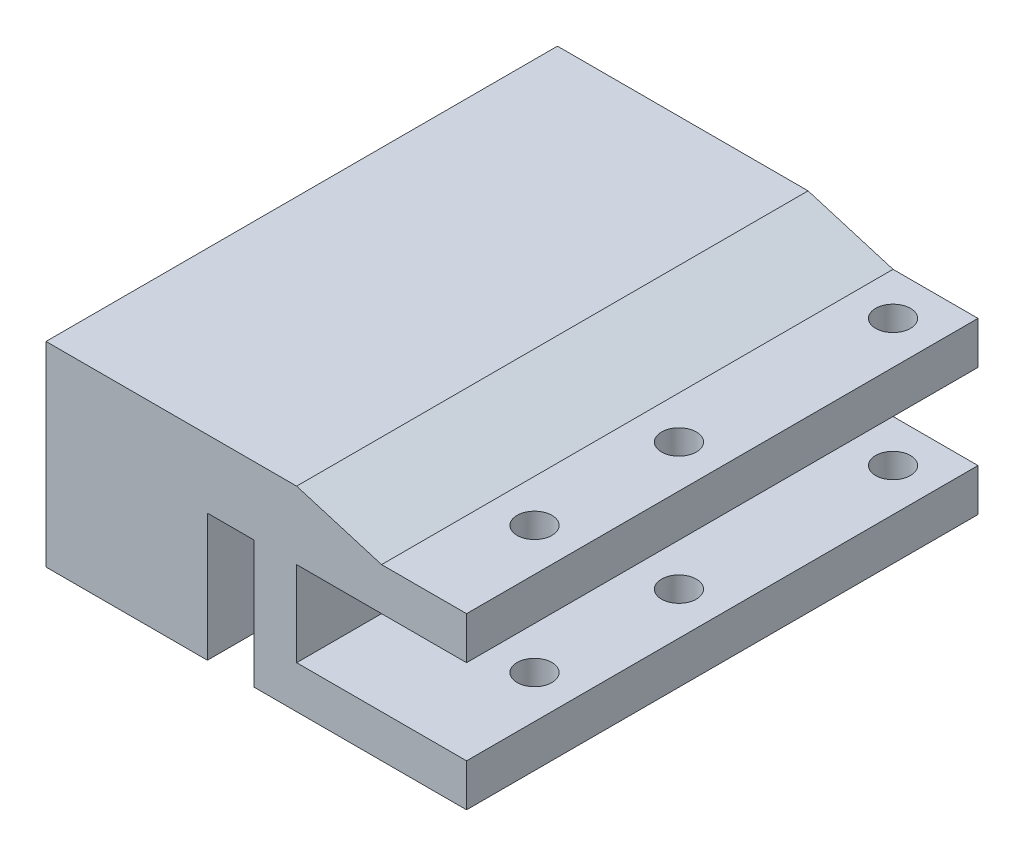
ISO-10303-21;
HEADER;
FILE_DESCRIPTION(('STEP AP214'),'2;1');
FILE_NAME('part.step','',(''),(''),'','','');
FILE_SCHEMA(('AUTOMOTIVE_DESIGN { 1 0 10303 214 1 1 1 1 }'));
ENDSEC;
DATA;
#1=APPLICATION_CONTEXT('core data for automotive mechanical design processes');
#2=APPLICATION_PROTOCOL_DEFINITION('international standard','automotive_design',2000,#1);
#3=PRODUCT_CONTEXT('',#1,'mechanical');
#4=PRODUCT('Part','Part','',(#3));
#5=PRODUCT_RELATED_PRODUCT_CATEGORY('part','',(#4));
#6=PRODUCT_DEFINITION_FORMATION('','',#4);
#7=PRODUCT_DEFINITION_CONTEXT('part definition',#1,'design');
#8=PRODUCT_DEFINITION('design','',#6,#7);
#9=PRODUCT_DEFINITION_SHAPE('','',#8);
#10=(LENGTH_UNIT() NAMED_UNIT(*) SI_UNIT(.MILLI.,.METRE.));
#11=(NAMED_UNIT(*) PLANE_ANGLE_UNIT() SI_UNIT($,.RADIAN.));
#12=(NAMED_UNIT(*) SI_UNIT($,.STERADIAN.) SOLID_ANGLE_UNIT());
#13=UNCERTAINTY_MEASURE_WITH_UNIT(LENGTH_MEASURE(1.E-05),#10,'distance_accuracy_value','');
#14=(GEOMETRIC_REPRESENTATION_CONTEXT(3) GLOBAL_UNCERTAINTY_ASSIGNED_CONTEXT((#13)) GLOBAL_UNIT_ASSIGNED_CONTEXT((#10,
#11,#12)) REPRESENTATION_CONTEXT('',''));
#15=CARTESIAN_POINT('',(0.,0.,0.));
#16=DIRECTION('',(0.,0.,1.));
#17=DIRECTION('',(1.,0.,0.));
#18=AXIS2_PLACEMENT_3D('',#15,#16,#17);
#19=CARTESIAN_POINT('',(0.,0.,10.));
#20=DIRECTION('',(0.,1.,0.));
#21=DIRECTION('',(0.,0.,1.));
#22=AXIS2_PLACEMENT_3D('',#19,#20,#21);
#23=PLANE('',#22);
#24=DIRECTION('',(1.,0.,0.));
#25=VECTOR('',#24,1.);
#26=CARTESIAN_POINT('',(0.,0.,0.));
#27=LINE('',#26,#25);
#28=CARTESIAN_POINT('',(0.,0.,0.));
#29=VERTEX_POINT('',#28);
#30=CARTESIAN_POINT('',(19.,0.,0.));
#31=VERTEX_POINT('',#30);
#32=EDGE_CURVE('E196',#29,#31,#27,.T.);
#33=ORIENTED_EDGE('',*,*,#32,.T.);
#34=DIRECTION('',(0.,0.,1.));
#35=VECTOR('',#34,1.);
#36=CARTESIAN_POINT('',(19.,0.,-10.));
#37=LINE('',#36,#35);
#38=CARTESIAN_POINT('',(19.,0.,10.));
#39=VERTEX_POINT('',#38);
#40=EDGE_CURVE('E179',#31,#39,#37,.T.);
#41=ORIENTED_EDGE('',*,*,#40,.T.);
#42=DIRECTION('',(1.,0.,0.));
#43=VECTOR('',#42,1.);
#44=CARTESIAN_POINT('',(0.,0.,10.));
#45=LINE('',#44,#43);
#46=CARTESIAN_POINT('',(0.,0.,10.));
#47=VERTEX_POINT('',#46);
#48=EDGE_CURVE('E194',#47,#39,#45,.T.);
#49=ORIENTED_EDGE('',*,*,#48,.F.);
#50=DIRECTION('',(0.,0.,-1.));
#51=VECTOR('',#50,1.);
#52=CARTESIAN_POINT('',(0.,0.,10.));
#53=LINE('',#52,#51);
#54=EDGE_CURVE('E227',#47,#29,#53,.T.);
#55=ORIENTED_EDGE('',*,*,#54,.T.);
#56=EDGE_LOOP('',(#33,#41,#49,#55));
#57=FACE_BOUND('',#56,.T.);
#58=ADVANCED_FACE('F38',(#57),#23,.F.);
#59=CARTESIAN_POINT('',(0.,0.,0.));
#60=DIRECTION('',(0.,0.,1.));
#61=DIRECTION('',(1.,0.,0.));
#62=AXIS2_PLACEMENT_3D('',#59,#60,#61);
#63=PLANE('',#62);
#64=DIRECTION('',(-1.,0.,0.));
#65=VECTOR('',#64,1.);
#66=CARTESIAN_POINT('',(0.,15.,0.));
#67=LINE('',#66,#65);
#68=CARTESIAN_POINT('',(24.5,15.,0.));
#69=VERTEX_POINT('',#68);
#70=CARTESIAN_POINT('',(19.,15.,0.));
#71=VERTEX_POINT('',#70);
#72=EDGE_CURVE('E289',#69,#71,#67,.T.);
#73=ORIENTED_EDGE('',*,*,#72,.T.);
#74=DIRECTION('',(0.,-1.,0.));
#75=VECTOR('',#74,1.);
#76=CARTESIAN_POINT('',(19.,0.,0.));
#77=LINE('',#76,#75);
#78=EDGE_CURVE('E292',#71,#31,#77,.T.);
#79=ORIENTED_EDGE('',*,*,#78,.T.);
#80=ORIENTED_EDGE('',*,*,#32,.F.);
#81=DIRECTION('',(0.,-1.,0.));
#82=VECTOR('',#81,1.);
#83=CARTESIAN_POINT('',(0.,0.,0.));
#84=LINE('',#83,#82);
#85=CARTESIAN_POINT('',(0.,20.,0.));
#86=VERTEX_POINT('',#85);
#87=EDGE_CURVE('E208',#86,#29,#84,.T.);
#88=ORIENTED_EDGE('',*,*,#87,.F.);
#89=DIRECTION('',(-1.,0.,0.));
#90=VECTOR('',#89,1.);
#91=CARTESIAN_POINT('',(0.,20.,0.));
#92=LINE('',#91,#90);
#93=CARTESIAN_POINT('',(29.5,20.,0.));
#94=VERTEX_POINT('',#93);
#95=EDGE_CURVE('E63',#94,#86,#92,.T.);
#96=ORIENTED_EDGE('',*,*,#95,.F.);
#97=DIRECTION('',(0.,1.,0.));
#98=VECTOR('',#97,1.);
#99=CARTESIAN_POINT('',(29.5,20.,0.));
#100=LINE('',#99,#98);
#101=CARTESIAN_POINT('',(29.5,15.,0.));
#102=VERTEX_POINT('',#101);
#103=EDGE_CURVE('E357',#102,#94,#100,.T.);
#104=ORIENTED_EDGE('',*,*,#103,.F.);
#105=DIRECTION('',(0.,1.,0.));
#106=VECTOR('',#105,1.);
#107=CARTESIAN_POINT('',(29.5,15.,0.));
#108=LINE('',#107,#106);
#109=CARTESIAN_POINT('',(29.5,5.,0.));
#110=VERTEX_POINT('',#109);
#111=EDGE_CURVE('E229',#110,#102,#108,.T.);
#112=ORIENTED_EDGE('',*,*,#111,.F.);
#113=DIRECTION('',(0.,1.,0.));
#114=VECTOR('',#113,1.);
#115=CARTESIAN_POINT('',(29.5,5.,0.));
#116=LINE('',#115,#114);
#117=CARTESIAN_POINT('',(29.5,0.,0.));
#118=VERTEX_POINT('',#117);
#119=EDGE_CURVE('E354',#118,#110,#116,.T.);
#120=ORIENTED_EDGE('',*,*,#119,.F.);
#121=CARTESIAN_POINT('',(24.5,0.,0.));
#122=VERTEX_POINT('',#121);
#123=EDGE_CURVE('E230',#122,#118,#27,.T.);
#124=ORIENTED_EDGE('',*,*,#123,.F.);
#125=DIRECTION('',(0.,1.,0.));
#126=VECTOR('',#125,1.);
#127=CARTESIAN_POINT('',(24.5,0.,0.));
#128=LINE('',#127,#126);
#129=EDGE_CURVE('E283',#122,#69,#128,.T.);
#130=ORIENTED_EDGE('',*,*,#129,.T.);
#131=EDGE_LOOP('',(#73,#79,#80,#88,#96,#104,#112,#120,#124,#130));
#132=FACE_BOUND('',#131,.T.);
#133=ADVANCED_FACE('F378',(#132),#63,.F.);
#134=CARTESIAN_POINT('',(44.5,0.,-3.));
#135=DIRECTION('',(0.,-1.,0.));
#136=DIRECTION('',(0.,0.,-1.));
#137=AXIS2_PLACEMENT_3D('',#134,#135,#136);
#138=CIRCLE('',#137,2.04999999999999);
#139=CARTESIAN_POINT('',(44.5,0.,-5.04999999999999));
#140=VERTEX_POINT('',#139);
#141=EDGE_CURVE('E255',#140,#140,#138,.T.);
#142=ORIENTED_EDGE('',*,*,#141,.F.);
#143=EDGE_LOOP('',(#142));
#144=FACE_BOUND('',#143,.T.);
#145=CARTESIAN_POINT('',(44.5,0.,-45.2));
#146=DIRECTION('',(0.,-1.,0.));
#147=DIRECTION('',(0.,0.,-1.));
#148=AXIS2_PLACEMENT_3D('',#145,#146,#147);
#149=CIRCLE('',#148,2.04999999999999);
#150=CARTESIAN_POINT('',(44.5,0.,-47.25));
#151=VERTEX_POINT('',#150);
#152=EDGE_CURVE('E459',#151,#151,#149,.T.);
#153=ORIENTED_EDGE('',*,*,#152,.F.);
#154=EDGE_LOOP('',(#153));
#155=FACE_BOUND('',#154,.T.);
#156=CARTESIAN_POINT('',(44.5,0.,-20.));
#157=DIRECTION('',(0.,-1.,0.));
#158=DIRECTION('',(0.,0.,-1.));
#159=AXIS2_PLACEMENT_3D('',#156,#157,#158);
#160=CIRCLE('',#159,2.04999999999999);
#161=CARTESIAN_POINT('',(44.5,0.,-22.05));
#162=VERTEX_POINT('',#161);
#163=EDGE_CURVE('E462',#162,#162,#160,.T.);
#164=ORIENTED_EDGE('',*,*,#163,.F.);
#165=EDGE_LOOP('',(#164));
#166=FACE_BOUND('',#165,.T.);
#167=CARTESIAN_POINT('',(24.5,0.,10.));
#168=VERTEX_POINT('',#167);
#169=CARTESIAN_POINT('',(49.5,0.,10.));
#170=VERTEX_POINT('',#169);
#171=EDGE_CURVE('E204',#168,#170,#45,.T.);
#172=ORIENTED_EDGE('',*,*,#171,.F.);
#173=DIRECTION('',(0.,0.,1.));
#174=VECTOR('',#173,1.);
#175=CARTESIAN_POINT('',(24.5,0.,-10.));
#176=LINE('',#175,#174);
#177=EDGE_CURVE('E55',#122,#168,#176,.T.);
#178=ORIENTED_EDGE('',*,*,#177,.F.);
#179=ORIENTED_EDGE('',*,*,#123,.T.);
#180=DIRECTION('',(0.,0.,1.));
#181=VECTOR('',#180,1.);
#182=CARTESIAN_POINT('',(29.5,0.,-20.1));
#183=LINE('',#182,#181);
#184=CARTESIAN_POINT('',(29.5,0.,-40.2));
#185=VERTEX_POINT('',#184);
#186=EDGE_CURVE('E349',#185,#118,#183,.T.);
#187=ORIENTED_EDGE('',*,*,#186,.F.);
#188=DIRECTION('',(1.,0.,0.));
#189=VECTOR('',#188,1.);
#190=CARTESIAN_POINT('',(0.,0.,-40.2));
#191=LINE('',#190,#189);
#192=CARTESIAN_POINT('',(0.,0.,-40.2));
#193=VERTEX_POINT('',#192);
#194=EDGE_CURVE('E303',#193,#185,#191,.T.);
#195=ORIENTED_EDGE('',*,*,#194,.F.);
#196=DIRECTION('',(0.,0.,1.));
#197=VECTOR('',#196,1.);
#198=CARTESIAN_POINT('',(0.,0.,-50.2));
#199=LINE('',#198,#197);
#200=CARTESIAN_POINT('',(0.,0.,-50.2));
#201=VERTEX_POINT('',#200);
#202=EDGE_CURVE('E334',#201,#193,#199,.T.);
#203=ORIENTED_EDGE('',*,*,#202,.F.);
#204=DIRECTION('',(1.,0.,0.));
#205=VECTOR('',#204,1.);
#206=CARTESIAN_POINT('',(0.,0.,-50.2));
#207=LINE('',#206,#205);
#208=CARTESIAN_POINT('',(49.5,0.,-50.2));
#209=VERTEX_POINT('',#208);
#210=EDGE_CURVE('E304',#201,#209,#207,.T.);
#211=ORIENTED_EDGE('',*,*,#210,.T.);
#212=DIRECTION('',(0.,0.,-1.));
#213=VECTOR('',#212,1.);
#214=CARTESIAN_POINT('',(49.5,0.,10.));
#215=LINE('',#214,#213);
#216=EDGE_CURVE('E11',#170,#209,#215,.T.);
#217=ORIENTED_EDGE('',*,*,#216,.F.);
#218=EDGE_LOOP('',(#172,#178,#179,#187,#195,#203,#211,#217));
#219=FACE_BOUND('',#218,.T.);
#220=ADVANCED_FACE('F40',(#144,#155,#166,#219),#23,.F.);
#221=CARTESIAN_POINT('',(49.5,0.,10.));
#222=DIRECTION('',(-1.,0.,0.));
#223=DIRECTION('',(0.,0.,1.));
#224=AXIS2_PLACEMENT_3D('',#221,#222,#223);
#225=PLANE('',#224);
#226=ORIENTED_EDGE('',*,*,#216,.T.);
#227=DIRECTION('',(0.,1.,0.));
#228=VECTOR('',#227,1.);
#229=CARTESIAN_POINT('',(49.5,0.,-50.2));
#230=LINE('',#229,#228);
#231=CARTESIAN_POINT('',(49.5,5.,-50.2));
#232=VERTEX_POINT('',#231);
#233=EDGE_CURVE('E307',#209,#232,#230,.T.);
#234=ORIENTED_EDGE('',*,*,#233,.T.);
#235=DIRECTION('',(0.,0.,-1.));
#236=VECTOR('',#235,1.);
#237=CARTESIAN_POINT('',(49.5,5.,10.));
#238=LINE('',#237,#236);
#239=CARTESIAN_POINT('',(49.5,5.,10.));
#240=VERTEX_POINT('',#239);
#241=EDGE_CURVE('E47',#240,#232,#238,.T.);
#242=ORIENTED_EDGE('',*,*,#241,.F.);
#243=DIRECTION('',(0.,1.,0.));
#244=VECTOR('',#243,1.);
#245=CARTESIAN_POINT('',(49.5,0.,10.));
#246=LINE('',#245,#244);
#247=EDGE_CURVE('E203',#170,#240,#246,.T.);
#248=ORIENTED_EDGE('',*,*,#247,.F.);
#249=EDGE_LOOP('',(#226,#234,#242,#248));
#250=FACE_BOUND('',#249,.T.);
#251=ADVANCED_FACE('F418',(#250),#225,.F.);
#252=CARTESIAN_POINT('',(29.5,5.,10.));
#253=DIRECTION('',(0.,-1.,0.));
#254=DIRECTION('',(1.,0.,0.));
#255=AXIS2_PLACEMENT_3D('',#252,#253,#254);
#256=PLANE('',#255);
#257=CARTESIAN_POINT('',(44.5,5.,-3.));
#258=DIRECTION('',(0.,-1.,0.));
#259=DIRECTION('',(1.,0.,0.));
#260=AXIS2_PLACEMENT_3D('',#257,#258,#259);
#261=CIRCLE('',#260,2.04999999999999);
#262=CARTESIAN_POINT('',(46.55,5.,-3.));
#263=VERTEX_POINT('',#262);
#264=EDGE_CURVE('E188',#263,#263,#261,.T.);
#265=ORIENTED_EDGE('',*,*,#264,.T.);
#266=EDGE_LOOP('',(#265));
#267=FACE_BOUND('',#266,.T.);
#268=CARTESIAN_POINT('',(44.5,5.,-45.2));
#269=DIRECTION('',(0.,-1.,0.));
#270=DIRECTION('',(1.,0.,0.));
#271=AXIS2_PLACEMENT_3D('',#268,#269,#270);
#272=CIRCLE('',#271,2.04999999999999);
#273=CARTESIAN_POINT('',(46.55,5.,-45.2));
#274=VERTEX_POINT('',#273);
#275=EDGE_CURVE('E263',#274,#274,#272,.T.);
#276=ORIENTED_EDGE('',*,*,#275,.T.);
#277=EDGE_LOOP('',(#276));
#278=FACE_BOUND('',#277,.T.);
#279=CARTESIAN_POINT('',(44.5,5.,-20.));
#280=DIRECTION('',(0.,-1.,0.));
#281=DIRECTION('',(1.,0.,0.));
#282=AXIS2_PLACEMENT_3D('',#279,#280,#281);
#283=CIRCLE('',#282,2.04999999999999);
#284=CARTESIAN_POINT('',(46.55,5.,-20.));
#285=VERTEX_POINT('',#284);
#286=EDGE_CURVE('E259',#285,#285,#283,.T.);
#287=ORIENTED_EDGE('',*,*,#286,.T.);
#288=EDGE_LOOP('',(#287));
#289=FACE_BOUND('',#288,.T.);
#290=ORIENTED_EDGE('',*,*,#241,.T.);
#291=DIRECTION('',(-1.,0.,0.));
#292=VECTOR('',#291,1.);
#293=CARTESIAN_POINT('',(29.5,5.,-50.2));
#294=LINE('',#293,#292);
#295=CARTESIAN_POINT('',(29.5,5.,-50.2));
#296=VERTEX_POINT('',#295);
#297=EDGE_CURVE('E311',#232,#296,#294,.T.);
#298=ORIENTED_EDGE('',*,*,#297,.T.);
#299=DIRECTION('',(0.,0.,1.));
#300=VECTOR('',#299,1.);
#301=CARTESIAN_POINT('',(29.5,5.,-50.2));
#302=LINE('',#301,#300);
#303=CARTESIAN_POINT('',(29.5,5.,-40.2));
#304=VERTEX_POINT('',#303);
#305=EDGE_CURVE('E346',#296,#304,#302,.T.);
#306=ORIENTED_EDGE('',*,*,#305,.T.);
#307=DIRECTION('',(0.,0.,1.));
#308=VECTOR('',#307,1.);
#309=CARTESIAN_POINT('',(29.5,5.,-20.1));
#310=LINE('',#309,#308);
#311=EDGE_CURVE('E352',#304,#110,#310,.T.);
#312=ORIENTED_EDGE('',*,*,#311,.T.);
#313=DIRECTION('',(0.,0.,-1.));
#314=VECTOR('',#313,1.);
#315=CARTESIAN_POINT('',(29.5,5.,10.));
#316=LINE('',#315,#314);
#317=CARTESIAN_POINT('',(29.5,5.,10.));
#318=VERTEX_POINT('',#317);
#319=EDGE_CURVE('E248',#318,#110,#316,.T.);
#320=ORIENTED_EDGE('',*,*,#319,.F.);
#321=DIRECTION('',(-1.,0.,0.));
#322=VECTOR('',#321,1.);
#323=CARTESIAN_POINT('',(29.5,5.,10.));
#324=LINE('',#323,#322);
#325=EDGE_CURVE('E206',#240,#318,#324,.T.);
#326=ORIENTED_EDGE('',*,*,#325,.F.);
#327=EDGE_LOOP('',(#290,#298,#306,#312,#320,#326));
#328=FACE_BOUND('',#327,.T.);
#329=ADVANCED_FACE('F415',(#267,#278,#289,#328),#256,.F.);
#330=CARTESIAN_POINT('',(29.5,15.,10.));
#331=DIRECTION('',(-1.,0.,0.));
#332=DIRECTION('',(0.,-1.,0.));
#333=AXIS2_PLACEMENT_3D('',#330,#331,#332);
#334=PLANE('',#333);
#335=ORIENTED_EDGE('',*,*,#111,.T.);
#336=DIRECTION('',(0.,0.,-1.));
#337=VECTOR('',#336,1.);
#338=CARTESIAN_POINT('',(29.5,15.,10.));
#339=LINE('',#338,#337);
#340=CARTESIAN_POINT('',(29.5,15.,10.));
#341=VERTEX_POINT('',#340);
#342=EDGE_CURVE('E245',#341,#102,#339,.T.);
#343=ORIENTED_EDGE('',*,*,#342,.F.);
#344=DIRECTION('',(0.,1.,0.));
#345=VECTOR('',#344,1.);
#346=CARTESIAN_POINT('',(29.5,15.,10.));
#347=LINE('',#346,#345);
#348=EDGE_CURVE('E214',#318,#341,#347,.T.);
#349=ORIENTED_EDGE('',*,*,#348,.F.);
#350=ORIENTED_EDGE('',*,*,#319,.T.);
#351=EDGE_LOOP('',(#335,#343,#349,#350));
#352=FACE_BOUND('',#351,.T.);
#353=ADVANCED_FACE('F381',(#352),#334,.F.);
#354=CARTESIAN_POINT('',(49.5,15.,10.));
#355=DIRECTION('',(0.,1.,0.));
#356=DIRECTION('',(-1.,0.,0.));
#357=AXIS2_PLACEMENT_3D('',#354,#355,#356);
#358=PLANE('',#357);
#359=CARTESIAN_POINT('',(44.5,15.,-3.));
#360=DIRECTION('',(0.,1.,0.));
#361=DIRECTION('',(-1.,0.,0.));
#362=AXIS2_PLACEMENT_3D('',#359,#360,#361);
#363=CIRCLE('',#362,2.04999999999999);
#364=CARTESIAN_POINT('',(42.45,15.,-3.));
#365=VERTEX_POINT('',#364);
#366=EDGE_CURVE('E275',#365,#365,#363,.T.);
#367=ORIENTED_EDGE('',*,*,#366,.T.);
#368=EDGE_LOOP('',(#367));
#369=FACE_BOUND('',#368,.T.);
#370=CARTESIAN_POINT('',(44.5,15.,-45.2));
#371=DIRECTION('',(0.,1.,0.));
#372=DIRECTION('',(-1.,0.,0.));
#373=AXIS2_PLACEMENT_3D('',#370,#371,#372);
#374=CIRCLE('',#373,2.04999999999999);
#375=CARTESIAN_POINT('',(42.45,15.,-45.2));
#376=VERTEX_POINT('',#375);
#377=EDGE_CURVE('E258',#376,#376,#374,.T.);
#378=ORIENTED_EDGE('',*,*,#377,.T.);
#379=EDGE_LOOP('',(#378));
#380=FACE_BOUND('',#379,.T.);
#381=CARTESIAN_POINT('',(44.5,15.,-20.));
#382=DIRECTION('',(0.,1.,0.));
#383=DIRECTION('',(-1.,0.,0.));
#384=AXIS2_PLACEMENT_3D('',#381,#382,#383);
#385=CIRCLE('',#384,2.04999999999999);
#386=CARTESIAN_POINT('',(42.45,15.,-20.));
#387=VERTEX_POINT('',#386);
#388=EDGE_CURVE('E254',#387,#387,#385,.T.);
#389=ORIENTED_EDGE('',*,*,#388,.T.);
#390=EDGE_LOOP('',(#389));
#391=FACE_BOUND('',#390,.T.);
#392=ORIENTED_EDGE('',*,*,#342,.T.);
#393=DIRECTION('',(0.,0.,1.));
#394=VECTOR('',#393,1.);
#395=CARTESIAN_POINT('',(29.5,15.,-20.1));
#396=LINE('',#395,#394);
#397=CARTESIAN_POINT('',(29.5,15.,-40.2));
#398=VERTEX_POINT('',#397);
#399=EDGE_CURVE('E361',#398,#102,#396,.T.);
#400=ORIENTED_EDGE('',*,*,#399,.F.);
#401=DIRECTION('',(0.,0.,1.));
#402=VECTOR('',#401,1.);
#403=CARTESIAN_POINT('',(29.5,15.,-50.2));
#404=LINE('',#403,#402);
#405=CARTESIAN_POINT('',(29.5,15.,-50.2));
#406=VERTEX_POINT('',#405);
#407=EDGE_CURVE('E343',#406,#398,#404,.T.);
#408=ORIENTED_EDGE('',*,*,#407,.F.);
#409=DIRECTION('',(1.,0.,0.));
#410=VECTOR('',#409,1.);
#411=CARTESIAN_POINT('',(49.5,15.,-50.2));
#412=LINE('',#411,#410);
#413=CARTESIAN_POINT('',(49.5,15.,-50.2));
#414=VERTEX_POINT('',#413);
#415=EDGE_CURVE('E317',#406,#414,#412,.T.);
#416=ORIENTED_EDGE('',*,*,#415,.T.);
#417=DIRECTION('',(0.,0.,-1.));
#418=VECTOR('',#417,1.);
#419=CARTESIAN_POINT('',(49.5,15.,10.));
#420=LINE('',#419,#418);
#421=CARTESIAN_POINT('',(49.5,15.,10.));
#422=VERTEX_POINT('',#421);
#423=EDGE_CURVE('E243',#422,#414,#420,.T.);
#424=ORIENTED_EDGE('',*,*,#423,.F.);
#425=DIRECTION('',(1.,0.,0.));
#426=VECTOR('',#425,1.);
#427=CARTESIAN_POINT('',(49.5,15.,10.));
#428=LINE('',#427,#426);
#429=EDGE_CURVE('E216',#341,#422,#428,.T.);
#430=ORIENTED_EDGE('',*,*,#429,.F.);
#431=EDGE_LOOP('',(#392,#400,#408,#416,#424,#430));
#432=FACE_BOUND('',#431,.T.);
#433=ADVANCED_FACE('F386',(#369,#380,#391,#432),#358,.F.);
#434=CARTESIAN_POINT('',(49.5,15.,10.));
#435=DIRECTION('',(-1.,0.,0.));
#436=DIRECTION('',(0.,0.,1.));
#437=AXIS2_PLACEMENT_3D('',#434,#435,#436);
#438=PLANE('',#437);
#439=ORIENTED_EDGE('',*,*,#423,.T.);
#440=DIRECTION('',(0.,1.,0.));
#441=VECTOR('',#440,1.);
#442=CARTESIAN_POINT('',(49.5,15.,-50.2));
#443=LINE('',#442,#441);
#444=CARTESIAN_POINT('',(49.5,20.,-50.2));
#445=VERTEX_POINT('',#444);
#446=EDGE_CURVE('E320',#414,#445,#443,.T.);
#447=ORIENTED_EDGE('',*,*,#446,.T.);
#448=DIRECTION('',(0.,0.,-1.));
#449=VECTOR('',#448,1.);
#450=CARTESIAN_POINT('',(49.5,20.,10.));
#451=LINE('',#450,#449);
#452=CARTESIAN_POINT('',(49.5,20.,10.));
#453=VERTEX_POINT('',#452);
#454=EDGE_CURVE('E241',#453,#445,#451,.T.);
#455=ORIENTED_EDGE('',*,*,#454,.F.);
#456=DIRECTION('',(0.,1.,0.));
#457=VECTOR('',#456,1.);
#458=CARTESIAN_POINT('',(49.5,15.,10.));
#459=LINE('',#458,#457);
#460=EDGE_CURVE('E218',#422,#453,#459,.T.);
#461=ORIENTED_EDGE('',*,*,#460,.F.);
#462=EDGE_LOOP('',(#439,#447,#455,#461));
#463=FACE_BOUND('',#462,.T.);
#464=ADVANCED_FACE('F408',(#463),#438,.F.);
#465=CARTESIAN_POINT('',(49.5,20.,10.));
#466=DIRECTION('',(0.,-1.,0.));
#467=DIRECTION('',(0.,0.,-1.));
#468=AXIS2_PLACEMENT_3D('',#465,#466,#467);
#469=PLANE('',#468);
#470=CARTESIAN_POINT('',(44.5,20.,-3.));
#471=DIRECTION('',(0.,-1.,0.));
#472=DIRECTION('',(0.,0.,-1.));
#473=AXIS2_PLACEMENT_3D('',#470,#471,#472);
#474=CIRCLE('',#473,2.04999999999999);
#475=CARTESIAN_POINT('',(44.5,20.,-5.04999999999999));
#476=VERTEX_POINT('',#475);
#477=EDGE_CURVE('E42',#476,#476,#474,.T.);
#478=ORIENTED_EDGE('',*,*,#477,.T.);
#479=EDGE_LOOP('',(#478));
#480=FACE_BOUND('',#479,.T.);
#481=CARTESIAN_POINT('',(44.5,20.,-45.2));
#482=DIRECTION('',(0.,-1.,0.));
#483=DIRECTION('',(0.,0.,-1.));
#484=AXIS2_PLACEMENT_3D('',#481,#482,#483);
#485=CIRCLE('',#484,2.04999999999999);
#486=CARTESIAN_POINT('',(44.5,20.,-47.25));
#487=VERTEX_POINT('',#486);
#488=EDGE_CURVE('E256',#487,#487,#485,.T.);
#489=ORIENTED_EDGE('',*,*,#488,.T.);
#490=EDGE_LOOP('',(#489));
#491=FACE_BOUND('',#490,.T.);
#492=CARTESIAN_POINT('',(44.5,20.,-20.));
#493=DIRECTION('',(0.,-1.,0.));
#494=DIRECTION('',(0.,0.,-1.));
#495=AXIS2_PLACEMENT_3D('',#492,#493,#494);
#496=CIRCLE('',#495,2.04999999999999);
#497=CARTESIAN_POINT('',(44.5,20.,-22.05));
#498=VERTEX_POINT('',#497);
#499=EDGE_CURVE('E252',#498,#498,#496,.T.);
#500=ORIENTED_EDGE('',*,*,#499,.T.);
#501=EDGE_LOOP('',(#500));
#502=FACE_BOUND('',#501,.T.);
#503=ORIENTED_EDGE('',*,*,#454,.T.);
#504=DIRECTION('',(-1.,0.,0.));
#505=VECTOR('',#504,1.);
#506=CARTESIAN_POINT('',(49.5,20.,-50.2));
#507=LINE('',#506,#505);
#508=CARTESIAN_POINT('',(39.5,20.,-50.2));
#509=VERTEX_POINT('',#508);
#510=EDGE_CURVE('E323',#445,#509,#507,.T.);
#511=ORIENTED_EDGE('',*,*,#510,.T.);
#512=DIRECTION('',(0.,0.,-1.));
#513=VECTOR('',#512,1.);
#514=CARTESIAN_POINT('',(39.5,20.,10.));
#515=LINE('',#514,#513);
#516=CARTESIAN_POINT('',(39.5,20.,10.));
#517=VERTEX_POINT('',#516);
#518=EDGE_CURVE('E239',#517,#509,#515,.T.);
#519=ORIENTED_EDGE('',*,*,#518,.F.);
#520=DIRECTION('',(-1.,0.,0.));
#521=VECTOR('',#520,1.);
#522=CARTESIAN_POINT('',(49.5,20.,10.));
#523=LINE('',#522,#521);
#524=EDGE_CURVE('E220',#453,#517,#523,.T.);
#525=ORIENTED_EDGE('',*,*,#524,.F.);
#526=EDGE_LOOP('',(#503,#511,#519,#525));
#527=FACE_BOUND('',#526,.T.);
#528=ADVANCED_FACE('F432',(#480,#491,#502,#527),#469,.F.);
#529=CARTESIAN_POINT('',(39.5,20.,10.));
#530=DIRECTION('',(-0.287347885566345,-0.957826285221152,0.));
#531=DIRECTION('',(0.957826285221152,-0.287347885566345,0.));
#532=AXIS2_PLACEMENT_3D('',#529,#530,#531);
#533=PLANE('',#532);
#534=ORIENTED_EDGE('',*,*,#518,.T.);
#535=DIRECTION('',(-0.957826285221152,0.287347885566345,0.));
#536=VECTOR('',#535,1.);
#537=CARTESIAN_POINT('',(39.5,20.,-50.2));
#538=LINE('',#537,#536);
#539=CARTESIAN_POINT('',(29.5,23.,-50.2));
#540=VERTEX_POINT('',#539);
#541=EDGE_CURVE('E326',#509,#540,#538,.T.);
#542=ORIENTED_EDGE('',*,*,#541,.T.);
#543=DIRECTION('',(0.,0.,-1.));
#544=VECTOR('',#543,1.);
#545=CARTESIAN_POINT('',(29.5,23.,10.));
#546=LINE('',#545,#544);
#547=CARTESIAN_POINT('',(29.5,23.,10.));
#548=VERTEX_POINT('',#547);
#549=EDGE_CURVE('E237',#548,#540,#546,.T.);
#550=ORIENTED_EDGE('',*,*,#549,.F.);
#551=DIRECTION('',(-0.957826285221152,0.287347885566345,0.));
#552=VECTOR('',#551,1.);
#553=CARTESIAN_POINT('',(39.5,20.,10.));
#554=LINE('',#553,#552);
#555=EDGE_CURVE('E222',#517,#548,#554,.T.);
#556=ORIENTED_EDGE('',*,*,#555,.F.);
#557=EDGE_LOOP('',(#534,#542,#550,#556));
#558=FACE_BOUND('',#557,.T.);
#559=ADVANCED_FACE('F430',(#558),#533,.F.);
#560=CARTESIAN_POINT('',(0.,23.,10.));
#561=DIRECTION('',(0.,-1.,0.));
#562=DIRECTION('',(0.,0.,-1.));
#563=AXIS2_PLACEMENT_3D('',#560,#561,#562);
#564=PLANE('',#563);
#565=ORIENTED_EDGE('',*,*,#549,.T.);
#566=DIRECTION('',(-1.,0.,0.));
#567=VECTOR('',#566,1.);
#568=CARTESIAN_POINT('',(0.,23.,-50.2));
#569=LINE('',#568,#567);
#570=CARTESIAN_POINT('',(0.,23.,-50.2));
#571=VERTEX_POINT('',#570);
#572=EDGE_CURVE('E329',#540,#571,#569,.T.);
#573=ORIENTED_EDGE('',*,*,#572,.T.);
#574=DIRECTION('',(0.,0.,-1.));
#575=VECTOR('',#574,1.);
#576=CARTESIAN_POINT('',(0.,23.,10.));
#577=LINE('',#576,#575);
#578=CARTESIAN_POINT('',(0.,23.,10.));
#579=VERTEX_POINT('',#578);
#580=EDGE_CURVE('E235',#579,#571,#577,.T.);
#581=ORIENTED_EDGE('',*,*,#580,.F.);
#582=DIRECTION('',(-1.,0.,0.));
#583=VECTOR('',#582,1.);
#584=CARTESIAN_POINT('',(0.,23.,10.));
#585=LINE('',#584,#583);
#586=EDGE_CURVE('E224',#548,#579,#585,.T.);
#587=ORIENTED_EDGE('',*,*,#586,.F.);
#588=EDGE_LOOP('',(#565,#573,#581,#587));
#589=FACE_BOUND('',#588,.T.);
#590=ADVANCED_FACE('F425',(#589),#564,.F.);
#591=CARTESIAN_POINT('',(0.,0.,10.));
#592=DIRECTION('',(1.,0.,0.));
#593=DIRECTION('',(0.,0.,-1.));
#594=AXIS2_PLACEMENT_3D('',#591,#592,#593);
#595=PLANE('',#594);
#596=CARTESIAN_POINT('',(0.,5.,-44.1));
#597=DIRECTION('',(1.,0.,0.));
#598=DIRECTION('',(0.,0.,-1.));
#599=AXIS2_PLACEMENT_3D('',#596,#597,#598);
#600=CIRCLE('',#599,2.);
#601=CARTESIAN_POINT('',(0.,5.,-46.1));
#602=VERTEX_POINT('',#601);
#603=EDGE_CURVE('E486',#602,#602,#600,.T.);
#604=ORIENTED_EDGE('',*,*,#603,.T.);
#605=EDGE_LOOP('',(#604));
#606=FACE_BOUND('',#605,.T.);
#607=CARTESIAN_POINT('',(0.,15.,-44.1));
#608=DIRECTION('',(1.,0.,0.));
#609=DIRECTION('',(0.,0.,-1.));
#610=AXIS2_PLACEMENT_3D('',#607,#608,#609);
#611=CIRCLE('',#610,2.);
#612=CARTESIAN_POINT('',(0.,15.,-46.1));
#613=VERTEX_POINT('',#612);
#614=EDGE_CURVE('E480',#613,#613,#611,.T.);
#615=ORIENTED_EDGE('',*,*,#614,.T.);
#616=EDGE_LOOP('',(#615));
#617=FACE_BOUND('',#616,.T.);
#618=CARTESIAN_POINT('',(0.,5.,3.9));
#619=DIRECTION('',(-1.,0.,0.));
#620=DIRECTION('',(0.,0.,1.));
#621=AXIS2_PLACEMENT_3D('',#618,#619,#620);
#622=CIRCLE('',#621,2.);
#623=CARTESIAN_POINT('',(0.,5.,5.9));
#624=VERTEX_POINT('',#623);
#625=EDGE_CURVE('E467',#624,#624,#622,.T.);
#626=ORIENTED_EDGE('',*,*,#625,.F.);
#627=EDGE_LOOP('',(#626));
#628=FACE_BOUND('',#627,.T.);
#629=CARTESIAN_POINT('',(0.,15.,3.9));
#630=DIRECTION('',(-1.,0.,0.));
#631=DIRECTION('',(0.,0.,1.));
#632=AXIS2_PLACEMENT_3D('',#629,#630,#631);
#633=CIRCLE('',#632,2.);
#634=CARTESIAN_POINT('',(0.,15.,5.9));
#635=VERTEX_POINT('',#634);
#636=EDGE_CURVE('E474',#635,#635,#633,.T.);
#637=ORIENTED_EDGE('',*,*,#636,.F.);
#638=EDGE_LOOP('',(#637));
#639=FACE_BOUND('',#638,.T.);
#640=ORIENTED_EDGE('',*,*,#580,.T.);
#641=DIRECTION('',(0.,-1.,0.));
#642=VECTOR('',#641,1.);
#643=CARTESIAN_POINT('',(0.,0.,-50.2));
#644=LINE('',#643,#642);
#645=EDGE_CURVE('E332',#571,#201,#644,.T.);
#646=ORIENTED_EDGE('',*,*,#645,.T.);
#647=ORIENTED_EDGE('',*,*,#202,.T.);
#648=DIRECTION('',(0.,-1.,0.));
#649=VECTOR('',#648,1.);
#650=CARTESIAN_POINT('',(0.,0.,-40.2));
#651=LINE('',#650,#649);
#652=CARTESIAN_POINT('',(0.,20.,-40.2));
#653=VERTEX_POINT('',#652);
#654=EDGE_CURVE('E308',#653,#193,#651,.T.);
#655=ORIENTED_EDGE('',*,*,#654,.F.);
#656=DIRECTION('',(0.,0.,1.));
#657=VECTOR('',#656,1.);
#658=CARTESIAN_POINT('',(0.,20.,-20.1));
#659=LINE('',#658,#657);
#660=EDGE_CURVE('E363',#653,#86,#659,.T.);
#661=ORIENTED_EDGE('',*,*,#660,.T.);
#662=ORIENTED_EDGE('',*,*,#87,.T.);
#663=ORIENTED_EDGE('',*,*,#54,.F.);
#664=DIRECTION('',(0.,-1.,0.));
#665=VECTOR('',#664,1.);
#666=CARTESIAN_POINT('',(0.,0.,10.));
#667=LINE('',#666,#665);
#668=EDGE_CURVE('E201',#579,#47,#667,.T.);
#669=ORIENTED_EDGE('',*,*,#668,.F.);
#670=EDGE_LOOP('',(#640,#646,#647,#655,#661,#662,#663,#669));
#671=FACE_BOUND('',#670,.T.);
#672=ADVANCED_FACE('F564',(#606,#617,#628,#639,#671),#595,.F.);
#673=CARTESIAN_POINT('',(0.,0.,10.));
#674=DIRECTION('',(0.,0.,1.));
#675=DIRECTION('',(1.,0.,0.));
#676=AXIS2_PLACEMENT_3D('',#673,#674,#675);
#677=PLANE('',#676);
#678=DIRECTION('',(0.,-1.,0.));
#679=VECTOR('',#678,1.);
#680=CARTESIAN_POINT('',(19.,0.,10.));
#681=LINE('',#680,#679);
#682=CARTESIAN_POINT('',(19.,15.,10.));
#683=VERTEX_POINT('',#682);
#684=EDGE_CURVE('E176',#683,#39,#681,.T.);
#685=ORIENTED_EDGE('',*,*,#684,.F.);
#686=DIRECTION('',(-1.,0.,0.));
#687=VECTOR('',#686,1.);
#688=CARTESIAN_POINT('',(19.,15.,10.));
#689=LINE('',#688,#687);
#690=CARTESIAN_POINT('',(24.5,15.,10.));
#691=VERTEX_POINT('',#690);
#692=EDGE_CURVE('E197',#691,#683,#689,.T.);
#693=ORIENTED_EDGE('',*,*,#692,.F.);
#694=DIRECTION('',(0.,1.,0.));
#695=VECTOR('',#694,1.);
#696=CARTESIAN_POINT('',(24.5,0.,10.));
#697=LINE('',#696,#695);
#698=EDGE_CURVE('E187',#168,#691,#697,.T.);
#699=ORIENTED_EDGE('',*,*,#698,.F.);
#700=ORIENTED_EDGE('',*,*,#171,.T.);
#701=ORIENTED_EDGE('',*,*,#247,.T.);
#702=ORIENTED_EDGE('',*,*,#325,.T.);
#703=ORIENTED_EDGE('',*,*,#348,.T.);
#704=ORIENTED_EDGE('',*,*,#429,.T.);
#705=ORIENTED_EDGE('',*,*,#460,.T.);
#706=ORIENTED_EDGE('',*,*,#524,.T.);
#707=ORIENTED_EDGE('',*,*,#555,.T.);
#708=ORIENTED_EDGE('',*,*,#586,.T.);
#709=ORIENTED_EDGE('',*,*,#668,.T.);
#710=ORIENTED_EDGE('',*,*,#48,.T.);
#711=EDGE_LOOP('',(#685,#693,#699,#700,#701,#702,#703,#704,#705,#706,#707,#708,#709,#710));
#712=FACE_BOUND('',#711,.T.);
#713=ADVANCED_FACE('F199',(#712),#677,.T.);
#714=CARTESIAN_POINT('',(29.5,20.,-20.1));
#715=DIRECTION('',(1.,0.,0.));
#716=DIRECTION('',(0.,0.,-1.));
#717=AXIS2_PLACEMENT_3D('',#714,#715,#716);
#718=PLANE('',#717);
#719=ORIENTED_EDGE('',*,*,#103,.T.);
#720=DIRECTION('',(0.,0.,1.));
#721=VECTOR('',#720,1.);
#722=CARTESIAN_POINT('',(29.5,20.,-20.1));
#723=LINE('',#722,#721);
#724=CARTESIAN_POINT('',(29.5,20.,-40.2));
#725=VERTEX_POINT('',#724);
#726=EDGE_CURVE('E210',#725,#94,#723,.T.);
#727=ORIENTED_EDGE('',*,*,#726,.F.);
#728=DIRECTION('',(0.,1.,0.));
#729=VECTOR('',#728,1.);
#730=CARTESIAN_POINT('',(29.5,20.,-40.2));
#731=LINE('',#730,#729);
#732=EDGE_CURVE('E297',#398,#725,#731,.T.);
#733=ORIENTED_EDGE('',*,*,#732,.F.);
#734=ORIENTED_EDGE('',*,*,#399,.T.);
#735=EDGE_LOOP('',(#719,#727,#733,#734));
#736=FACE_BOUND('',#735,.T.);
#737=ADVANCED_FACE('F391',(#736),#718,.F.);
#738=CARTESIAN_POINT('',(0.,20.,-20.1));
#739=DIRECTION('',(0.,1.,0.));
#740=DIRECTION('',(0.,0.,1.));
#741=AXIS2_PLACEMENT_3D('',#738,#739,#740);
#742=PLANE('',#741);
#743=ORIENTED_EDGE('',*,*,#95,.T.);
#744=ORIENTED_EDGE('',*,*,#660,.F.);
#745=DIRECTION('',(-1.,0.,0.));
#746=VECTOR('',#745,1.);
#747=CARTESIAN_POINT('',(0.,20.,-40.2));
#748=LINE('',#747,#746);
#749=EDGE_CURVE('E300',#725,#653,#748,.T.);
#750=ORIENTED_EDGE('',*,*,#749,.F.);
#751=ORIENTED_EDGE('',*,*,#726,.T.);
#752=EDGE_LOOP('',(#743,#744,#750,#751));
#753=FACE_BOUND('',#752,.T.);
#754=ADVANCED_FACE('F558',(#753),#742,.F.);
#755=CARTESIAN_POINT('',(29.5,5.,-20.1));
#756=DIRECTION('',(1.,0.,0.));
#757=DIRECTION('',(0.,0.,-1.));
#758=AXIS2_PLACEMENT_3D('',#755,#756,#757);
#759=PLANE('',#758);
#760=ORIENTED_EDGE('',*,*,#119,.T.);
#761=ORIENTED_EDGE('',*,*,#311,.F.);
#762=DIRECTION('',(0.,1.,0.));
#763=VECTOR('',#762,1.);
#764=CARTESIAN_POINT('',(29.5,5.,-40.2));
#765=LINE('',#764,#763);
#766=EDGE_CURVE('E294',#185,#304,#765,.T.);
#767=ORIENTED_EDGE('',*,*,#766,.F.);
#768=ORIENTED_EDGE('',*,*,#186,.T.);
#769=EDGE_LOOP('',(#760,#761,#767,#768));
#770=FACE_BOUND('',#769,.T.);
#771=ADVANCED_FACE('F376',(#770),#759,.F.);
#772=CARTESIAN_POINT('',(0.,0.,-40.2));
#773=DIRECTION('',(0.,0.,-1.));
#774=DIRECTION('',(1.,0.,0.));
#775=AXIS2_PLACEMENT_3D('',#772,#773,#774);
#776=PLANE('',#775);
#777=ORIENTED_EDGE('',*,*,#766,.T.);
#778=DIRECTION('',(0.,1.,0.));
#779=VECTOR('',#778,1.);
#780=CARTESIAN_POINT('',(29.5,15.,-40.2));
#781=LINE('',#780,#779);
#782=EDGE_CURVE('E337',#304,#398,#781,.T.);
#783=ORIENTED_EDGE('',*,*,#782,.T.);
#784=ORIENTED_EDGE('',*,*,#732,.T.);
#785=ORIENTED_EDGE('',*,*,#749,.T.);
#786=ORIENTED_EDGE('',*,*,#654,.T.);
#787=ORIENTED_EDGE('',*,*,#194,.T.);
#788=EDGE_LOOP('',(#777,#783,#784,#785,#786,#787));
#789=FACE_BOUND('',#788,.T.);
#790=ADVANCED_FACE('F394',(#789),#776,.F.);
#791=CARTESIAN_POINT('',(29.5,15.,-50.2));
#792=DIRECTION('',(-1.,0.,0.));
#793=DIRECTION('',(0.,-1.,0.));
#794=AXIS2_PLACEMENT_3D('',#791,#792,#793);
#795=PLANE('',#794);
#796=ORIENTED_EDGE('',*,*,#782,.F.);
#797=ORIENTED_EDGE('',*,*,#305,.F.);
#798=DIRECTION('',(0.,1.,0.));
#799=VECTOR('',#798,1.);
#800=CARTESIAN_POINT('',(29.5,15.,-50.2));
#801=LINE('',#800,#799);
#802=EDGE_CURVE('E314',#296,#406,#801,.T.);
#803=ORIENTED_EDGE('',*,*,#802,.T.);
#804=ORIENTED_EDGE('',*,*,#407,.T.);
#805=EDGE_LOOP('',(#796,#797,#803,#804));
#806=FACE_BOUND('',#805,.T.);
#807=ADVANCED_FACE('F397',(#806),#795,.F.);
#808=CARTESIAN_POINT('',(0.,0.,-50.2));
#809=DIRECTION('',(0.,0.,-1.));
#810=DIRECTION('',(1.,0.,0.));
#811=AXIS2_PLACEMENT_3D('',#808,#809,#810);
#812=PLANE('',#811);
#813=ORIENTED_EDGE('',*,*,#210,.F.);
#814=ORIENTED_EDGE('',*,*,#645,.F.);
#815=ORIENTED_EDGE('',*,*,#572,.F.);
#816=ORIENTED_EDGE('',*,*,#541,.F.);
#817=ORIENTED_EDGE('',*,*,#510,.F.);
#818=ORIENTED_EDGE('',*,*,#446,.F.);
#819=ORIENTED_EDGE('',*,*,#415,.F.);
#820=ORIENTED_EDGE('',*,*,#802,.F.);
#821=ORIENTED_EDGE('',*,*,#297,.F.);
#822=ORIENTED_EDGE('',*,*,#233,.F.);
#823=EDGE_LOOP('',(#813,#814,#815,#816,#817,#818,#819,#820,#821,#822));
#824=FACE_BOUND('',#823,.T.);
#825=ADVANCED_FACE('F402',(#824),#812,.T.);
#826=CARTESIAN_POINT('',(19.,0.,-10.));
#827=DIRECTION('',(-1.,0.,0.));
#828=DIRECTION('',(0.,0.,1.));
#829=AXIS2_PLACEMENT_3D('',#826,#827,#828);
#830=PLANE('',#829);
#831=DIRECTION('',(0.,0.,1.));
#832=VECTOR('',#831,1.);
#833=CARTESIAN_POINT('',(19.,15.,-10.));
#834=LINE('',#833,#832);
#835=EDGE_CURVE('E182',#71,#683,#834,.T.);
#836=ORIENTED_EDGE('',*,*,#835,.T.);
#837=ORIENTED_EDGE('',*,*,#684,.T.);
#838=ORIENTED_EDGE('',*,*,#40,.F.);
#839=ORIENTED_EDGE('',*,*,#78,.F.);
#840=EDGE_LOOP('',(#836,#837,#838,#839));
#841=FACE_BOUND('',#840,.T.);
#842=ADVANCED_FACE('F178',(#841),#830,.F.);
#843=CARTESIAN_POINT('',(19.,15.,-10.));
#844=DIRECTION('',(0.,1.,0.));
#845=DIRECTION('',(0.,0.,1.));
#846=AXIS2_PLACEMENT_3D('',#843,#844,#845);
#847=PLANE('',#846);
#848=DIRECTION('',(0.,0.,1.));
#849=VECTOR('',#848,1.);
#850=CARTESIAN_POINT('',(24.5,15.,-10.));
#851=LINE('',#850,#849);
#852=EDGE_CURVE('E284',#69,#691,#851,.T.);
#853=ORIENTED_EDGE('',*,*,#852,.T.);
#854=ORIENTED_EDGE('',*,*,#692,.T.);
#855=ORIENTED_EDGE('',*,*,#835,.F.);
#856=ORIENTED_EDGE('',*,*,#72,.F.);
#857=EDGE_LOOP('',(#853,#854,#855,#856));
#858=FACE_BOUND('',#857,.T.);
#859=ADVANCED_FACE('F541',(#858),#847,.F.);
#860=CARTESIAN_POINT('',(24.5,0.,-10.));
#861=DIRECTION('',(1.,0.,0.));
#862=DIRECTION('',(0.,0.,-1.));
#863=AXIS2_PLACEMENT_3D('',#860,#861,#862);
#864=PLANE('',#863);
#865=ORIENTED_EDGE('',*,*,#177,.T.);
#866=ORIENTED_EDGE('',*,*,#698,.T.);
#867=ORIENTED_EDGE('',*,*,#852,.F.);
#868=ORIENTED_EDGE('',*,*,#129,.F.);
#869=EDGE_LOOP('',(#865,#866,#867,#868));
#870=FACE_BOUND('',#869,.T.);
#871=ADVANCED_FACE('F544',(#870),#864,.F.);
#872=CARTESIAN_POINT('',(44.5,50.,-20.));
#873=DIRECTION('',(0.,-1.,0.));
#874=DIRECTION('',(0.,0.,-1.));
#875=AXIS2_PLACEMENT_3D('',#872,#873,#874);
#876=CYLINDRICAL_SURFACE('',#875,2.04999999999999);
#877=ORIENTED_EDGE('',*,*,#499,.F.);
#878=EDGE_LOOP('',(#877));
#879=FACE_BOUND('',#878,.T.);
#880=ORIENTED_EDGE('',*,*,#388,.F.);
#881=EDGE_LOOP('',(#880));
#882=FACE_BOUND('',#881,.T.);
#883=ADVANCED_FACE('F540',(#879,#882),#876,.F.);
#884=CARTESIAN_POINT('',(44.5,50.,-45.2));
#885=DIRECTION('',(0.,-1.,0.));
#886=DIRECTION('',(0.,0.,-1.));
#887=AXIS2_PLACEMENT_3D('',#884,#885,#886);
#888=CYLINDRICAL_SURFACE('',#887,2.04999999999999);
#889=ORIENTED_EDGE('',*,*,#488,.F.);
#890=EDGE_LOOP('',(#889));
#891=FACE_BOUND('',#890,.T.);
#892=ORIENTED_EDGE('',*,*,#377,.F.);
#893=EDGE_LOOP('',(#892));
#894=FACE_BOUND('',#893,.T.);
#895=ADVANCED_FACE('F537',(#891,#894),#888,.F.);
#896=CARTESIAN_POINT('',(44.5,50.,-3.));
#897=DIRECTION('',(0.,-1.,0.));
#898=DIRECTION('',(0.,0.,-1.));
#899=AXIS2_PLACEMENT_3D('',#896,#897,#898);
#900=CYLINDRICAL_SURFACE('',#899,2.04999999999999);
#901=ORIENTED_EDGE('',*,*,#477,.F.);
#902=EDGE_LOOP('',(#901));
#903=FACE_BOUND('',#902,.T.);
#904=ORIENTED_EDGE('',*,*,#366,.F.);
#905=EDGE_LOOP('',(#904));
#906=FACE_BOUND('',#905,.T.);
#907=ADVANCED_FACE('F532',(#903,#906),#900,.F.);
#908=ORIENTED_EDGE('',*,*,#163,.T.);
#909=EDGE_LOOP('',(#908));
#910=FACE_BOUND('',#909,.T.);
#911=ORIENTED_EDGE('',*,*,#286,.F.);
#912=EDGE_LOOP('',(#911));
#913=FACE_BOUND('',#912,.T.);
#914=ADVANCED_FACE('F535',(#910,#913),#876,.F.);
#915=ORIENTED_EDGE('',*,*,#152,.T.);
#916=EDGE_LOOP('',(#915));
#917=FACE_BOUND('',#916,.T.);
#918=ORIENTED_EDGE('',*,*,#275,.F.);
#919=EDGE_LOOP('',(#918));
#920=FACE_BOUND('',#919,.T.);
#921=ADVANCED_FACE('F530',(#917,#920),#888,.F.);
#922=ORIENTED_EDGE('',*,*,#141,.T.);
#923=EDGE_LOOP('',(#922));
#924=FACE_BOUND('',#923,.T.);
#925=ORIENTED_EDGE('',*,*,#264,.F.);
#926=EDGE_LOOP('',(#925));
#927=FACE_BOUND('',#926,.T.);
#928=ADVANCED_FACE('F523',(#924,#927),#900,.F.);
#929=CARTESIAN_POINT('',(10.,15.,3.9));
#930=DIRECTION('',(-1.,0.,0.));
#931=DIRECTION('',(0.,0.,1.));
#932=AXIS2_PLACEMENT_3D('',#929,#930,#931);
#933=CYLINDRICAL_SURFACE('',#932,2.);
#934=CARTESIAN_POINT('',(10.,15.,3.9));
#935=DIRECTION('',(-1.,0.,0.));
#936=DIRECTION('',(0.,0.,1.));
#937=AXIS2_PLACEMENT_3D('',#934,#935,#936);
#938=CIRCLE('',#937,2.);
#939=CARTESIAN_POINT('',(10.,15.,5.9));
#940=VERTEX_POINT('',#939);
#941=EDGE_CURVE('E471',#940,#940,#938,.T.);
#942=ORIENTED_EDGE('',*,*,#941,.F.);
#943=EDGE_LOOP('',(#942));
#944=FACE_BOUND('',#943,.T.);
#945=ORIENTED_EDGE('',*,*,#636,.T.);
#946=EDGE_LOOP('',(#945));
#947=FACE_BOUND('',#946,.T.);
#948=ADVANCED_FACE('F520',(#944,#947),#933,.F.);
#949=CARTESIAN_POINT('',(10.,15.,3.9));
#950=DIRECTION('',(-1.,0.,0.));
#951=DIRECTION('',(0.,0.,1.));
#952=AXIS2_PLACEMENT_3D('',#949,#950,#951);
#953=PLANE('',#952);
#954=ORIENTED_EDGE('',*,*,#941,.T.);
#955=EDGE_LOOP('',(#954));
#956=FACE_BOUND('',#955,.T.);
#957=ADVANCED_FACE('F518',(#956),#953,.T.);
#958=CARTESIAN_POINT('',(10.,5.,3.9));
#959=DIRECTION('',(-1.,0.,0.));
#960=DIRECTION('',(0.,0.,1.));
#961=AXIS2_PLACEMENT_3D('',#958,#959,#960);
#962=CYLINDRICAL_SURFACE('',#961,2.);
#963=CARTESIAN_POINT('',(10.,5.,3.9));
#964=DIRECTION('',(-1.,0.,0.));
#965=DIRECTION('',(0.,0.,1.));
#966=AXIS2_PLACEMENT_3D('',#963,#964,#965);
#967=CIRCLE('',#966,2.);
#968=CARTESIAN_POINT('',(10.,5.,5.9));
#969=VERTEX_POINT('',#968);
#970=EDGE_CURVE('E464',#969,#969,#967,.T.);
#971=ORIENTED_EDGE('',*,*,#970,.F.);
#972=EDGE_LOOP('',(#971));
#973=FACE_BOUND('',#972,.T.);
#974=ORIENTED_EDGE('',*,*,#625,.T.);
#975=EDGE_LOOP('',(#974));
#976=FACE_BOUND('',#975,.T.);
#977=ADVANCED_FACE('F514',(#973,#976),#962,.F.);
#978=CARTESIAN_POINT('',(10.,5.,3.9));
#979=DIRECTION('',(-1.,0.,0.));
#980=DIRECTION('',(0.,0.,1.));
#981=AXIS2_PLACEMENT_3D('',#978,#979,#980);
#982=PLANE('',#981);
#983=ORIENTED_EDGE('',*,*,#970,.T.);
#984=EDGE_LOOP('',(#983));
#985=FACE_BOUND('',#984,.T.);
#986=ADVANCED_FACE('F510',(#985),#982,.T.);
#987=CARTESIAN_POINT('',(10.,15.,-44.1));
#988=DIRECTION('',(-1.,0.,0.));
#989=DIRECTION('',(0.,0.,1.));
#990=AXIS2_PLACEMENT_3D('',#987,#988,#989);
#991=CYLINDRICAL_SURFACE('',#990,2.);
#992=CARTESIAN_POINT('',(10.,15.,-44.1));
#993=DIRECTION('',(1.,0.,0.));
#994=DIRECTION('',(0.,0.,-1.));
#995=AXIS2_PLACEMENT_3D('',#992,#993,#994);
#996=CIRCLE('',#995,2.);
#997=CARTESIAN_POINT('',(10.,15.,-46.1));
#998=VERTEX_POINT('',#997);
#999=EDGE_CURVE('E483',#998,#998,#996,.T.);
#1000=ORIENTED_EDGE('',*,*,#999,.T.);
#1001=EDGE_LOOP('',(#1000));
#1002=FACE_BOUND('',#1001,.T.);
#1003=ORIENTED_EDGE('',*,*,#614,.F.);
#1004=EDGE_LOOP('',(#1003));
#1005=FACE_BOUND('',#1004,.T.);
#1006=ADVANCED_FACE('F506',(#1002,#1005),#991,.F.);
#1007=CARTESIAN_POINT('',(10.,15.,-44.1));
#1008=DIRECTION('',(-1.,0.,0.));
#1009=DIRECTION('',(0.,0.,-1.));
#1010=AXIS2_PLACEMENT_3D('',#1007,#1008,#1009);
#1011=PLANE('',#1010);
#1012=ORIENTED_EDGE('',*,*,#999,.F.);
#1013=EDGE_LOOP('',(#1012));
#1014=FACE_BOUND('',#1013,.T.);
#1015=ADVANCED_FACE('F501',(#1014),#1011,.T.);
#1016=CARTESIAN_POINT('',(10.,5.,-44.1));
#1017=DIRECTION('',(-1.,0.,0.));
#1018=DIRECTION('',(0.,0.,1.));
#1019=AXIS2_PLACEMENT_3D('',#1016,#1017,#1018);
#1020=CYLINDRICAL_SURFACE('',#1019,2.);
#1021=CARTESIAN_POINT('',(10.,5.,-44.1));
#1022=DIRECTION('',(1.,0.,0.));
#1023=DIRECTION('',(0.,0.,-1.));
#1024=AXIS2_PLACEMENT_3D('',#1021,#1022,#1023);
#1025=CIRCLE('',#1024,2.);
#1026=CARTESIAN_POINT('',(10.,5.,-46.1));
#1027=VERTEX_POINT('',#1026);
#1028=EDGE_CURVE('E475',#1027,#1027,#1025,.T.);
#1029=ORIENTED_EDGE('',*,*,#1028,.T.);
#1030=EDGE_LOOP('',(#1029));
#1031=FACE_BOUND('',#1030,.T.);
#1032=ORIENTED_EDGE('',*,*,#603,.F.);
#1033=EDGE_LOOP('',(#1032));
#1034=FACE_BOUND('',#1033,.T.);
#1035=ADVANCED_FACE('F492',(#1031,#1034),#1020,.F.);
#1036=CARTESIAN_POINT('',(10.,5.,-44.1));
#1037=DIRECTION('',(-1.,0.,0.));
#1038=DIRECTION('',(0.,0.,-1.));
#1039=AXIS2_PLACEMENT_3D('',#1036,#1037,#1038);
#1040=PLANE('',#1039);
#1041=ORIENTED_EDGE('',*,*,#1028,.F.);
#1042=EDGE_LOOP('',(#1041));
#1043=FACE_BOUND('',#1042,.T.);
#1044=ADVANCED_FACE('F495',(#1043),#1040,.T.);
#1045=CLOSED_SHELL('',(#58,#133,#220,#251,#329,#353,#433,#464,#528,#559,#590,#672,#713,#737,
#754,#771,#790,#807,#825,#842,#859,#871,#883,#895,#907,#914,#921,#928,#948,#957,#977,#986,#1006,
#1015,#1035,#1044));
#1046=MANIFOLD_SOLID_BREP('B2',#1045);
#1047=ADVANCED_BREP_SHAPE_REPRESENTATION('',(#18,#1046),#14);
#1048=SHAPE_DEFINITION_REPRESENTATION(#9,#1047);
ENDSEC;
END-ISO-10303-21;
